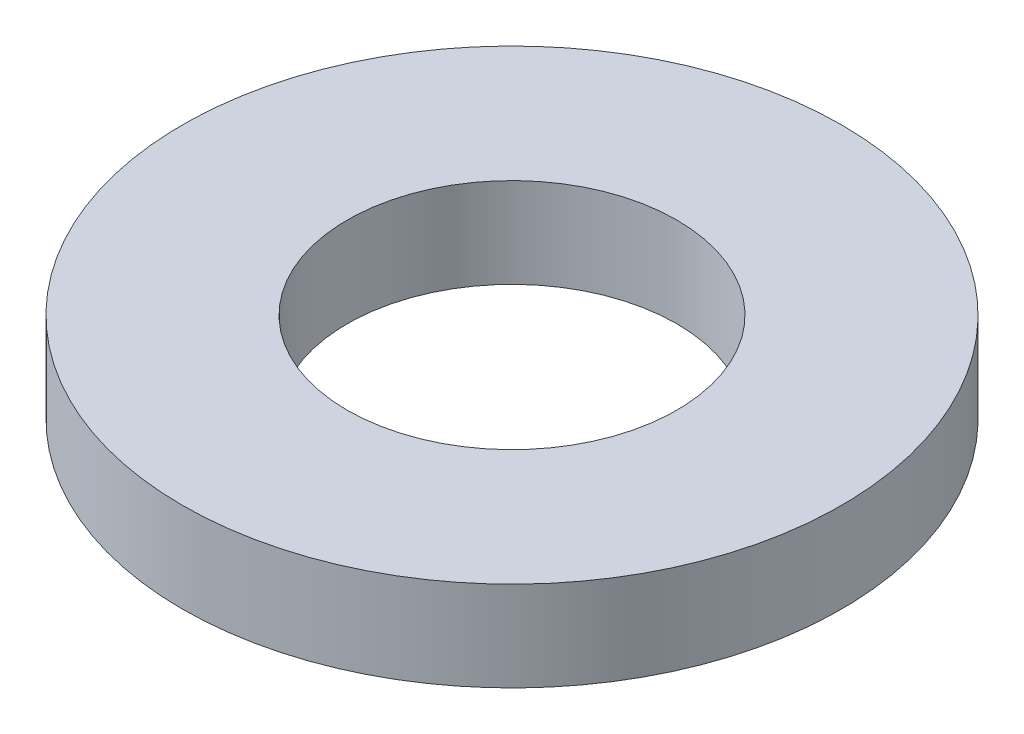
ISO-10303-21;
HEADER;
FILE_DESCRIPTION(('STEP AP214'),'2;1');
FILE_NAME('part.step','',(''),(''),'','','');
FILE_SCHEMA(('AUTOMOTIVE_DESIGN { 1 0 10303 214 1 1 1 1 }'));
ENDSEC;
DATA;
#1=APPLICATION_CONTEXT('core data for automotive mechanical design processes');
#2=APPLICATION_PROTOCOL_DEFINITION('international standard','automotive_design',2000,#1);
#3=PRODUCT_CONTEXT('',#1,'mechanical');
#4=PRODUCT('Part','Part','',(#3));
#5=PRODUCT_RELATED_PRODUCT_CATEGORY('part','',(#4));
#6=PRODUCT_DEFINITION_FORMATION('','',#4);
#7=PRODUCT_DEFINITION_CONTEXT('part definition',#1,'design');
#8=PRODUCT_DEFINITION('design','',#6,#7);
#9=PRODUCT_DEFINITION_SHAPE('','',#8);
#10=(LENGTH_UNIT() NAMED_UNIT(*) SI_UNIT(.MILLI.,.METRE.));
#11=(NAMED_UNIT(*) PLANE_ANGLE_UNIT() SI_UNIT($,.RADIAN.));
#12=(NAMED_UNIT(*) SI_UNIT($,.STERADIAN.) SOLID_ANGLE_UNIT());
#13=UNCERTAINTY_MEASURE_WITH_UNIT(LENGTH_MEASURE(1.E-05),#10,'distance_accuracy_value','');
#14=(GEOMETRIC_REPRESENTATION_CONTEXT(3) GLOBAL_UNCERTAINTY_ASSIGNED_CONTEXT((#13)) GLOBAL_UNIT_ASSIGNED_CONTEXT((#10,
#11,#12)) REPRESENTATION_CONTEXT('',''));
#15=CARTESIAN_POINT('',(0.,0.,0.));
#16=DIRECTION('',(0.,0.,1.));
#17=DIRECTION('',(1.,0.,0.));
#18=AXIS2_PLACEMENT_3D('',#15,#16,#17);
#19=CARTESIAN_POINT('',(0.,15.,0.));
#20=DIRECTION('',(0.,-1.,0.));
#21=DIRECTION('',(0.,0.,-1.));
#22=AXIS2_PLACEMENT_3D('',#19,#20,#21);
#23=CYLINDRICAL_SURFACE('',#22,55.);
#24=CARTESIAN_POINT('',(0.,15.,0.));
#25=DIRECTION('',(0.,1.,0.));
#26=DIRECTION('',(0.,0.,1.));
#27=AXIS2_PLACEMENT_3D('',#24,#25,#26);
#28=CIRCLE('',#27,55.);
#29=CARTESIAN_POINT('',(0.,15.,55.));
#30=VERTEX_POINT('',#29);
#31=EDGE_CURVE('E10',#30,#30,#28,.T.);
#32=ORIENTED_EDGE('',*,*,#31,.F.);
#33=EDGE_LOOP('',(#32));
#34=FACE_BOUND('',#33,.T.);
#35=CARTESIAN_POINT('',(0.,0.,0.));
#36=DIRECTION('',(0.,1.,0.));
#37=DIRECTION('',(0.,0.,1.));
#38=AXIS2_PLACEMENT_3D('',#35,#36,#37);
#39=CIRCLE('',#38,55.);
#40=CARTESIAN_POINT('',(0.,0.,55.));
#41=VERTEX_POINT('',#40);
#42=EDGE_CURVE('E37',#41,#41,#39,.T.);
#43=ORIENTED_EDGE('',*,*,#42,.T.);
#44=EDGE_LOOP('',(#43));
#45=FACE_BOUND('',#44,.T.);
#46=ADVANCED_FACE('F40',(#34,#45),#23,.T.);
#47=CARTESIAN_POINT('',(0.,15.,0.));
#48=DIRECTION('',(0.,1.,0.));
#49=DIRECTION('',(0.,0.,1.));
#50=AXIS2_PLACEMENT_3D('',#47,#48,#49);
#51=PLANE('',#50);
#52=CARTESIAN_POINT('',(0.,15.,0.));
#53=DIRECTION('',(0.,1.,0.));
#54=DIRECTION('',(0.,0.,1.));
#55=AXIS2_PLACEMENT_3D('',#52,#53,#54);
#56=CIRCLE('',#55,27.5);
#57=CARTESIAN_POINT('',(0.,15.,27.5));
#58=VERTEX_POINT('',#57);
#59=EDGE_CURVE('E50',#58,#58,#56,.T.);
#60=ORIENTED_EDGE('',*,*,#59,.F.);
#61=EDGE_LOOP('',(#60));
#62=FACE_BOUND('',#61,.T.);
#63=ORIENTED_EDGE('',*,*,#31,.T.);
#64=EDGE_LOOP('',(#63));
#65=FACE_BOUND('',#64,.T.);
#66=ADVANCED_FACE('F59',(#62,#65),#51,.T.);
#67=CARTESIAN_POINT('',(0.,0.,0.));
#68=DIRECTION('',(0.,1.,0.));
#69=DIRECTION('',(0.,0.,1.));
#70=AXIS2_PLACEMENT_3D('',#67,#68,#69);
#71=PLANE('',#70);
#72=CARTESIAN_POINT('',(0.,0.,0.));
#73=DIRECTION('',(0.,1.,0.));
#74=DIRECTION('',(0.,0.,1.));
#75=AXIS2_PLACEMENT_3D('',#72,#73,#74);
#76=CIRCLE('',#75,27.5);
#77=CARTESIAN_POINT('',(0.,0.,27.5));
#78=VERTEX_POINT('',#77);
#79=EDGE_CURVE('E47',#78,#78,#76,.T.);
#80=ORIENTED_EDGE('',*,*,#79,.T.);
#81=EDGE_LOOP('',(#80));
#82=FACE_BOUND('',#81,.T.);
#83=ORIENTED_EDGE('',*,*,#42,.F.);
#84=EDGE_LOOP('',(#83));
#85=FACE_BOUND('',#84,.T.);
#86=ADVANCED_FACE('F58',(#82,#85),#71,.F.);
#87=CARTESIAN_POINT('',(0.,15.,0.));
#88=DIRECTION('',(0.,-1.,0.));
#89=DIRECTION('',(0.,0.,-1.));
#90=AXIS2_PLACEMENT_3D('',#87,#88,#89);
#91=CYLINDRICAL_SURFACE('',#90,27.5);
#92=ORIENTED_EDGE('',*,*,#59,.T.);
#93=EDGE_LOOP('',(#92));
#94=FACE_BOUND('',#93,.T.);
#95=ORIENTED_EDGE('',*,*,#79,.F.);
#96=EDGE_LOOP('',(#95));
#97=FACE_BOUND('',#96,.T.);
#98=ADVANCED_FACE('F54',(#94,#97),#91,.F.);
#99=CLOSED_SHELL('',(#46,#66,#86,#98));
#100=MANIFOLD_SOLID_BREP('B2',#99);
#101=ADVANCED_BREP_SHAPE_REPRESENTATION('',(#18,#100),#14);
#102=SHAPE_DEFINITION_REPRESENTATION(#9,#101);
ENDSEC;
END-ISO-10303-21;
